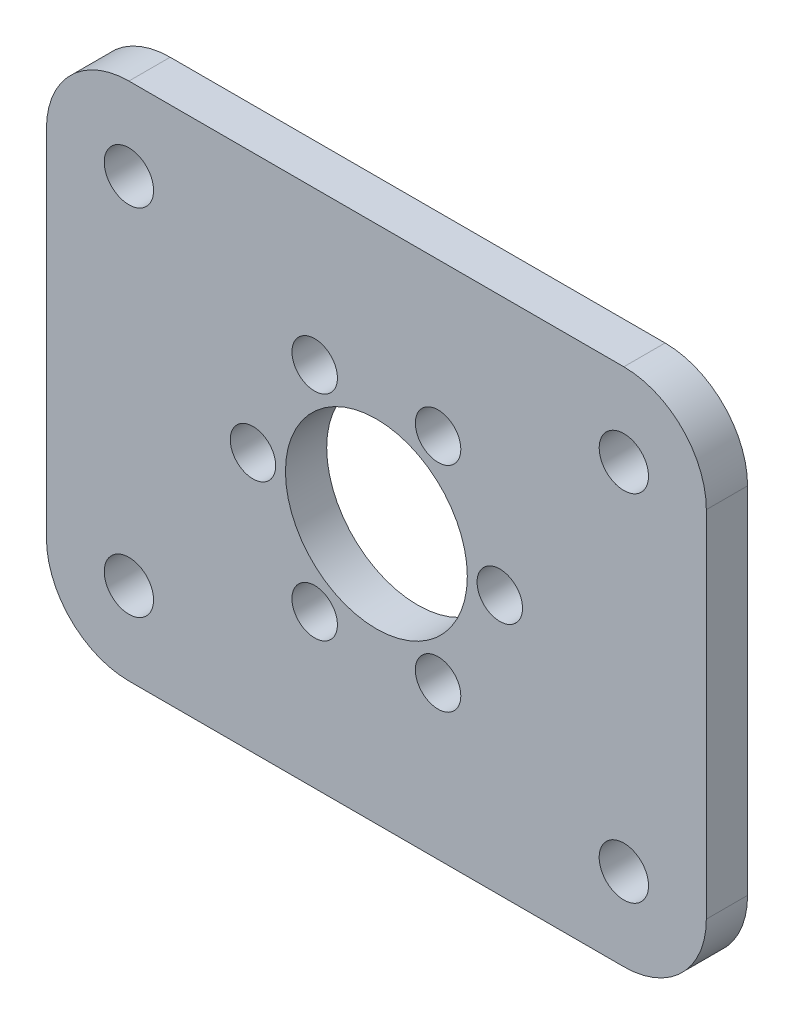
ISO-10303-21;
HEADER;
FILE_DESCRIPTION(('STEP AP214'),'2;1');
FILE_NAME('part.step','',(''),(''),'','','');
FILE_SCHEMA(('AUTOMOTIVE_DESIGN { 1 0 10303 214 1 1 1 1 }'));
ENDSEC;
DATA;
#1=APPLICATION_CONTEXT('core data for automotive mechanical design processes');
#2=APPLICATION_PROTOCOL_DEFINITION('international standard','automotive_design',2000,#1);
#3=PRODUCT_CONTEXT('',#1,'mechanical');
#4=PRODUCT('Part','Part','',(#3));
#5=PRODUCT_RELATED_PRODUCT_CATEGORY('part','',(#4));
#6=PRODUCT_DEFINITION_FORMATION('','',#4);
#7=PRODUCT_DEFINITION_CONTEXT('part definition',#1,'design');
#8=PRODUCT_DEFINITION('design','',#6,#7);
#9=PRODUCT_DEFINITION_SHAPE('','',#8);
#10=(LENGTH_UNIT() NAMED_UNIT(*) SI_UNIT(.MILLI.,.METRE.));
#11=(NAMED_UNIT(*) PLANE_ANGLE_UNIT() SI_UNIT($,.RADIAN.));
#12=(NAMED_UNIT(*) SI_UNIT($,.STERADIAN.) SOLID_ANGLE_UNIT());
#13=UNCERTAINTY_MEASURE_WITH_UNIT(LENGTH_MEASURE(1.E-05),#10,'distance_accuracy_value','');
#14=(GEOMETRIC_REPRESENTATION_CONTEXT(3) GLOBAL_UNCERTAINTY_ASSIGNED_CONTEXT((#13)) GLOBAL_UNIT_ASSIGNED_CONTEXT((#10,
#11,#12)) REPRESENTATION_CONTEXT('',''));
#15=CARTESIAN_POINT('',(0.,0.,0.));
#16=DIRECTION('',(0.,0.,1.));
#17=DIRECTION('',(1.,0.,0.));
#18=AXIS2_PLACEMENT_3D('',#15,#16,#17);
#19=CARTESIAN_POINT('',(-25.4,-20.,3.175));
#20=DIRECTION('',(0.,0.,1.));
#21=DIRECTION('',(1.,0.,0.));
#22=AXIS2_PLACEMENT_3D('',#19,#20,#21);
#23=PLANE('',#22);
#24=CARTESIAN_POINT('',(19.05,13.65,3.175));
#25=DIRECTION('',(0.,0.,1.));
#26=DIRECTION('',(-1.,0.,0.));
#27=AXIS2_PLACEMENT_3D('',#24,#25,#26);
#28=CIRCLE('',#27,1.89865);
#29=CARTESIAN_POINT('',(17.15135,13.65,3.175));
#30=VERTEX_POINT('',#29);
#31=EDGE_CURVE('E237',#30,#30,#28,.T.);
#32=ORIENTED_EDGE('',*,*,#31,.F.);
#33=EDGE_LOOP('',(#32));
#34=FACE_BOUND('',#33,.T.);
#35=CARTESIAN_POINT('',(-19.05,-13.65,3.175));
#36=DIRECTION('',(0.,0.,1.));
#37=DIRECTION('',(-1.,0.,0.));
#38=AXIS2_PLACEMENT_3D('',#35,#36,#37);
#39=CIRCLE('',#38,1.89865);
#40=CARTESIAN_POINT('',(-20.94865,-13.65,3.175));
#41=VERTEX_POINT('',#40);
#42=EDGE_CURVE('E231',#41,#41,#39,.T.);
#43=ORIENTED_EDGE('',*,*,#42,.F.);
#44=EDGE_LOOP('',(#43));
#45=FACE_BOUND('',#44,.T.);
#46=CARTESIAN_POINT('',(-19.05,13.65,3.175));
#47=DIRECTION('',(0.,0.,1.));
#48=DIRECTION('',(1.,0.,0.));
#49=AXIS2_PLACEMENT_3D('',#46,#47,#48);
#50=CIRCLE('',#49,1.89865);
#51=CARTESIAN_POINT('',(-17.15135,13.65,3.175));
#52=VERTEX_POINT('',#51);
#53=EDGE_CURVE('E225',#52,#52,#50,.T.);
#54=ORIENTED_EDGE('',*,*,#53,.F.);
#55=EDGE_LOOP('',(#54));
#56=FACE_BOUND('',#55,.T.);
#57=CARTESIAN_POINT('',(19.05,-13.65,3.175));
#58=DIRECTION('',(0.,0.,1.));
#59=DIRECTION('',(1.,0.,0.));
#60=AXIS2_PLACEMENT_3D('',#57,#58,#59);
#61=CIRCLE('',#60,1.89865);
#62=CARTESIAN_POINT('',(20.94865,-13.65,3.175));
#63=VERTEX_POINT('',#62);
#64=EDGE_CURVE('E219',#63,#63,#61,.T.);
#65=ORIENTED_EDGE('',*,*,#64,.F.);
#66=EDGE_LOOP('',(#65));
#67=FACE_BOUND('',#66,.T.);
#68=CARTESIAN_POINT('',(4.75,8.22724133595217,3.175));
#69=DIRECTION('',(0.,0.,1.));
#70=DIRECTION('',(1.,0.,0.));
#71=AXIS2_PLACEMENT_3D('',#68,#69,#70);
#72=CIRCLE('',#71,1.75);
#73=CARTESIAN_POINT('',(6.5,8.22724133595217,3.175));
#74=VERTEX_POINT('',#73);
#75=EDGE_CURVE('E213',#74,#74,#72,.T.);
#76=ORIENTED_EDGE('',*,*,#75,.F.);
#77=EDGE_LOOP('',(#76));
#78=FACE_BOUND('',#77,.T.);
#79=CARTESIAN_POINT('',(-4.75,8.22724133595217,3.175));
#80=DIRECTION('',(0.,0.,1.));
#81=DIRECTION('',(1.,0.,0.));
#82=AXIS2_PLACEMENT_3D('',#79,#80,#81);
#83=CIRCLE('',#82,1.75);
#84=CARTESIAN_POINT('',(-3.,8.22724133595217,3.175));
#85=VERTEX_POINT('',#84);
#86=EDGE_CURVE('E207',#85,#85,#83,.T.);
#87=ORIENTED_EDGE('',*,*,#86,.F.);
#88=EDGE_LOOP('',(#87));
#89=FACE_BOUND('',#88,.T.);
#90=CARTESIAN_POINT('',(-9.5,0.,3.175));
#91=DIRECTION('',(0.,0.,1.));
#92=DIRECTION('',(1.,0.,0.));
#93=AXIS2_PLACEMENT_3D('',#90,#91,#92);
#94=CIRCLE('',#93,1.75);
#95=CARTESIAN_POINT('',(-7.75,0.,3.175));
#96=VERTEX_POINT('',#95);
#97=EDGE_CURVE('E201',#96,#96,#94,.T.);
#98=ORIENTED_EDGE('',*,*,#97,.F.);
#99=EDGE_LOOP('',(#98));
#100=FACE_BOUND('',#99,.T.);
#101=CARTESIAN_POINT('',(-4.75,-8.22724133595217,3.175));
#102=DIRECTION('',(0.,0.,1.));
#103=DIRECTION('',(1.,0.,0.));
#104=AXIS2_PLACEMENT_3D('',#101,#102,#103);
#105=CIRCLE('',#104,1.75);
#106=CARTESIAN_POINT('',(-3.,-8.22724133595217,3.175));
#107=VERTEX_POINT('',#106);
#108=EDGE_CURVE('E195',#107,#107,#105,.T.);
#109=ORIENTED_EDGE('',*,*,#108,.F.);
#110=EDGE_LOOP('',(#109));
#111=FACE_BOUND('',#110,.T.);
#112=CARTESIAN_POINT('',(4.75,-8.22724133595217,3.175));
#113=DIRECTION('',(0.,0.,1.));
#114=DIRECTION('',(1.,0.,0.));
#115=AXIS2_PLACEMENT_3D('',#112,#113,#114);
#116=CIRCLE('',#115,1.75);
#117=CARTESIAN_POINT('',(6.5,-8.22724133595217,3.175));
#118=VERTEX_POINT('',#117);
#119=EDGE_CURVE('E189',#118,#118,#116,.T.);
#120=ORIENTED_EDGE('',*,*,#119,.F.);
#121=EDGE_LOOP('',(#120));
#122=FACE_BOUND('',#121,.T.);
#123=CARTESIAN_POINT('',(9.5,0.,3.175));
#124=DIRECTION('',(0.,0.,1.));
#125=DIRECTION('',(1.,0.,0.));
#126=AXIS2_PLACEMENT_3D('',#123,#124,#125);
#127=CIRCLE('',#126,1.75);
#128=CARTESIAN_POINT('',(11.25,0.,3.175));
#129=VERTEX_POINT('',#128);
#130=EDGE_CURVE('E183',#129,#129,#127,.T.);
#131=ORIENTED_EDGE('',*,*,#130,.F.);
#132=EDGE_LOOP('',(#131));
#133=FACE_BOUND('',#132,.T.);
#134=DIRECTION('',(0.,-1.,0.));
#135=VECTOR('',#134,1.);
#136=CARTESIAN_POINT('',(-25.4,20.,3.175));
#137=LINE('',#136,#135);
#138=CARTESIAN_POINT('',(-25.4,13.65,3.175));
#139=VERTEX_POINT('',#138);
#140=CARTESIAN_POINT('',(-25.4,-13.65,3.175));
#141=VERTEX_POINT('',#140);
#142=EDGE_CURVE('E137',#139,#141,#137,.T.);
#143=ORIENTED_EDGE('',*,*,#142,.T.);
#144=CARTESIAN_POINT('',(-19.05,-13.65,3.175));
#145=DIRECTION('',(0.,0.,1.));
#146=DIRECTION('',(1.,0.,0.));
#147=AXIS2_PLACEMENT_3D('',#144,#145,#146);
#148=CIRCLE('',#147,6.35);
#149=CARTESIAN_POINT('',(-19.05,-20.,3.175));
#150=VERTEX_POINT('',#149);
#151=EDGE_CURVE('E152',#141,#150,#148,.T.);
#152=ORIENTED_EDGE('',*,*,#151,.T.);
#153=DIRECTION('',(1.,0.,0.));
#154=VECTOR('',#153,1.);
#155=CARTESIAN_POINT('',(-25.4,-20.,3.175));
#156=LINE('',#155,#154);
#157=CARTESIAN_POINT('',(19.05,-20.,3.175));
#158=VERTEX_POINT('',#157);
#159=EDGE_CURVE('E119',#150,#158,#156,.T.);
#160=ORIENTED_EDGE('',*,*,#159,.T.);
#161=CARTESIAN_POINT('',(19.05,-13.65,3.175));
#162=DIRECTION('',(0.,0.,1.));
#163=DIRECTION('',(1.,0.,0.));
#164=AXIS2_PLACEMENT_3D('',#161,#162,#163);
#165=CIRCLE('',#164,6.35);
#166=CARTESIAN_POINT('',(25.4,-13.65,3.175));
#167=VERTEX_POINT('',#166);
#168=EDGE_CURVE('E150',#158,#167,#165,.T.);
#169=ORIENTED_EDGE('',*,*,#168,.T.);
#170=DIRECTION('',(0.,1.,0.));
#171=VECTOR('',#170,1.);
#172=CARTESIAN_POINT('',(25.4,20.,3.175));
#173=LINE('',#172,#171);
#174=CARTESIAN_POINT('',(25.4,13.65,3.175));
#175=VERTEX_POINT('',#174);
#176=EDGE_CURVE('E163',#167,#175,#173,.T.);
#177=ORIENTED_EDGE('',*,*,#176,.T.);
#178=CARTESIAN_POINT('',(19.05,13.65,3.175));
#179=DIRECTION('',(0.,0.,1.));
#180=DIRECTION('',(1.,0.,0.));
#181=AXIS2_PLACEMENT_3D('',#178,#179,#180);
#182=CIRCLE('',#181,6.35);
#183=CARTESIAN_POINT('',(19.05,20.,3.175));
#184=VERTEX_POINT('',#183);
#185=EDGE_CURVE('E54',#175,#184,#182,.T.);
#186=ORIENTED_EDGE('',*,*,#185,.T.);
#187=DIRECTION('',(-1.,0.,0.));
#188=VECTOR('',#187,1.);
#189=CARTESIAN_POINT('',(25.4,20.,3.175));
#190=LINE('',#189,#188);
#191=CARTESIAN_POINT('',(-19.05,20.,3.175));
#192=VERTEX_POINT('',#191);
#193=EDGE_CURVE('E138',#184,#192,#190,.T.);
#194=ORIENTED_EDGE('',*,*,#193,.T.);
#195=CARTESIAN_POINT('',(-19.05,13.65,3.175));
#196=DIRECTION('',(0.,0.,1.));
#197=DIRECTION('',(1.,0.,0.));
#198=AXIS2_PLACEMENT_3D('',#195,#196,#197);
#199=CIRCLE('',#198,6.35);
#200=EDGE_CURVE('E147',#192,#139,#199,.T.);
#201=ORIENTED_EDGE('',*,*,#200,.T.);
#202=EDGE_LOOP('',(#143,#152,#160,#169,#177,#186,#194,#201));
#203=FACE_BOUND('',#202,.T.);
#204=CARTESIAN_POINT('',(0.,0.,3.175));
#205=DIRECTION('',(0.,0.,1.));
#206=DIRECTION('',(1.,0.,0.));
#207=AXIS2_PLACEMENT_3D('',#204,#205,#206);
#208=CIRCLE('',#207,7.);
#209=CARTESIAN_POINT('',(7.,0.,3.175));
#210=VERTEX_POINT('',#209);
#211=EDGE_CURVE('E132',#210,#210,#208,.T.);
#212=ORIENTED_EDGE('',*,*,#211,.F.);
#213=EDGE_LOOP('',(#212));
#214=FACE_BOUND('',#213,.T.);
#215=ADVANCED_FACE('F33',(#34,#45,#56,#67,#78,#89,#100,#111,#122,#133,#203,#214),#23,.T.);
#216=CARTESIAN_POINT('',(-25.4,-20.,0.));
#217=DIRECTION('',(0.,0.,1.));
#218=DIRECTION('',(1.,0.,0.));
#219=AXIS2_PLACEMENT_3D('',#216,#217,#218);
#220=PLANE('',#219);
#221=CARTESIAN_POINT('',(19.05,13.65,0.));
#222=DIRECTION('',(0.,0.,1.));
#223=DIRECTION('',(-1.,0.,0.));
#224=AXIS2_PLACEMENT_3D('',#221,#222,#223);
#225=CIRCLE('',#224,1.89865);
#226=CARTESIAN_POINT('',(17.15135,13.65,0.));
#227=VERTEX_POINT('',#226);
#228=EDGE_CURVE('E222',#227,#227,#225,.T.);
#229=ORIENTED_EDGE('',*,*,#228,.T.);
#230=EDGE_LOOP('',(#229));
#231=FACE_BOUND('',#230,.T.);
#232=CARTESIAN_POINT('',(-19.05,-13.65,0.));
#233=DIRECTION('',(0.,0.,1.));
#234=DIRECTION('',(-1.,0.,0.));
#235=AXIS2_PLACEMENT_3D('',#232,#233,#234);
#236=CIRCLE('',#235,1.89865);
#237=CARTESIAN_POINT('',(-20.94865,-13.65,0.));
#238=VERTEX_POINT('',#237);
#239=EDGE_CURVE('E234',#238,#238,#236,.T.);
#240=ORIENTED_EDGE('',*,*,#239,.T.);
#241=EDGE_LOOP('',(#240));
#242=FACE_BOUND('',#241,.T.);
#243=CARTESIAN_POINT('',(-19.05,13.65,0.));
#244=DIRECTION('',(0.,0.,1.));
#245=DIRECTION('',(1.,0.,0.));
#246=AXIS2_PLACEMENT_3D('',#243,#244,#245);
#247=CIRCLE('',#246,1.89865);
#248=CARTESIAN_POINT('',(-17.15135,13.65,0.));
#249=VERTEX_POINT('',#248);
#250=EDGE_CURVE('E228',#249,#249,#247,.T.);
#251=ORIENTED_EDGE('',*,*,#250,.T.);
#252=EDGE_LOOP('',(#251));
#253=FACE_BOUND('',#252,.T.);
#254=CARTESIAN_POINT('',(19.05,-13.65,0.));
#255=DIRECTION('',(0.,0.,1.));
#256=DIRECTION('',(1.,0.,0.));
#257=AXIS2_PLACEMENT_3D('',#254,#255,#256);
#258=CIRCLE('',#257,1.89865);
#259=CARTESIAN_POINT('',(20.94865,-13.65,0.));
#260=VERTEX_POINT('',#259);
#261=EDGE_CURVE('E216',#260,#260,#258,.T.);
#262=ORIENTED_EDGE('',*,*,#261,.T.);
#263=EDGE_LOOP('',(#262));
#264=FACE_BOUND('',#263,.T.);
#265=CARTESIAN_POINT('',(4.75,8.22724133595217,0.));
#266=DIRECTION('',(0.,0.,1.));
#267=DIRECTION('',(1.,0.,0.));
#268=AXIS2_PLACEMENT_3D('',#265,#266,#267);
#269=CIRCLE('',#268,1.75);
#270=CARTESIAN_POINT('',(6.5,8.22724133595217,0.));
#271=VERTEX_POINT('',#270);
#272=EDGE_CURVE('E210',#271,#271,#269,.T.);
#273=ORIENTED_EDGE('',*,*,#272,.T.);
#274=EDGE_LOOP('',(#273));
#275=FACE_BOUND('',#274,.T.);
#276=CARTESIAN_POINT('',(-4.75,8.22724133595217,0.));
#277=DIRECTION('',(0.,0.,1.));
#278=DIRECTION('',(1.,0.,0.));
#279=AXIS2_PLACEMENT_3D('',#276,#277,#278);
#280=CIRCLE('',#279,1.75);
#281=CARTESIAN_POINT('',(-3.,8.22724133595217,0.));
#282=VERTEX_POINT('',#281);
#283=EDGE_CURVE('E204',#282,#282,#280,.T.);
#284=ORIENTED_EDGE('',*,*,#283,.T.);
#285=EDGE_LOOP('',(#284));
#286=FACE_BOUND('',#285,.T.);
#287=CARTESIAN_POINT('',(-9.5,0.,0.));
#288=DIRECTION('',(0.,0.,1.));
#289=DIRECTION('',(1.,0.,0.));
#290=AXIS2_PLACEMENT_3D('',#287,#288,#289);
#291=CIRCLE('',#290,1.75);
#292=CARTESIAN_POINT('',(-7.75,0.,0.));
#293=VERTEX_POINT('',#292);
#294=EDGE_CURVE('E198',#293,#293,#291,.T.);
#295=ORIENTED_EDGE('',*,*,#294,.T.);
#296=EDGE_LOOP('',(#295));
#297=FACE_BOUND('',#296,.T.);
#298=CARTESIAN_POINT('',(-4.75,-8.22724133595217,0.));
#299=DIRECTION('',(0.,0.,1.));
#300=DIRECTION('',(1.,0.,0.));
#301=AXIS2_PLACEMENT_3D('',#298,#299,#300);
#302=CIRCLE('',#301,1.75);
#303=CARTESIAN_POINT('',(-3.,-8.22724133595217,0.));
#304=VERTEX_POINT('',#303);
#305=EDGE_CURVE('E192',#304,#304,#302,.T.);
#306=ORIENTED_EDGE('',*,*,#305,.T.);
#307=EDGE_LOOP('',(#306));
#308=FACE_BOUND('',#307,.T.);
#309=CARTESIAN_POINT('',(4.75,-8.22724133595217,0.));
#310=DIRECTION('',(0.,0.,1.));
#311=DIRECTION('',(1.,0.,0.));
#312=AXIS2_PLACEMENT_3D('',#309,#310,#311);
#313=CIRCLE('',#312,1.75);
#314=CARTESIAN_POINT('',(6.5,-8.22724133595217,0.));
#315=VERTEX_POINT('',#314);
#316=EDGE_CURVE('E186',#315,#315,#313,.T.);
#317=ORIENTED_EDGE('',*,*,#316,.T.);
#318=EDGE_LOOP('',(#317));
#319=FACE_BOUND('',#318,.T.);
#320=CARTESIAN_POINT('',(9.5,0.,0.));
#321=DIRECTION('',(0.,0.,1.));
#322=DIRECTION('',(1.,0.,0.));
#323=AXIS2_PLACEMENT_3D('',#320,#321,#322);
#324=CIRCLE('',#323,1.75);
#325=CARTESIAN_POINT('',(11.25,0.,0.));
#326=VERTEX_POINT('',#325);
#327=EDGE_CURVE('E180',#326,#326,#324,.T.);
#328=ORIENTED_EDGE('',*,*,#327,.T.);
#329=EDGE_LOOP('',(#328));
#330=FACE_BOUND('',#329,.T.);
#331=DIRECTION('',(1.,0.,0.));
#332=VECTOR('',#331,1.);
#333=CARTESIAN_POINT('',(-25.4,-20.,0.));
#334=LINE('',#333,#332);
#335=CARTESIAN_POINT('',(-19.05,-20.,0.));
#336=VERTEX_POINT('',#335);
#337=CARTESIAN_POINT('',(19.05,-20.,0.));
#338=VERTEX_POINT('',#337);
#339=EDGE_CURVE('E116',#336,#338,#334,.T.);
#340=ORIENTED_EDGE('',*,*,#339,.F.);
#341=CARTESIAN_POINT('',(-19.05,-13.65,0.));
#342=DIRECTION('',(0.,0.,1.));
#343=DIRECTION('',(1.,0.,0.));
#344=AXIS2_PLACEMENT_3D('',#341,#342,#343);
#345=CIRCLE('',#344,6.35);
#346=CARTESIAN_POINT('',(-25.4,-13.65,0.));
#347=VERTEX_POINT('',#346);
#348=EDGE_CURVE('E99',#336,#347,#345,.F.);
#349=ORIENTED_EDGE('',*,*,#348,.T.);
#350=DIRECTION('',(0.,-1.,0.));
#351=VECTOR('',#350,1.);
#352=CARTESIAN_POINT('',(-25.4,20.,0.));
#353=LINE('',#352,#351);
#354=CARTESIAN_POINT('',(-25.4,13.65,0.));
#355=VERTEX_POINT('',#354);
#356=EDGE_CURVE('E127',#355,#347,#353,.T.);
#357=ORIENTED_EDGE('',*,*,#356,.F.);
#358=CARTESIAN_POINT('',(-19.05,13.65,0.));
#359=DIRECTION('',(0.,0.,1.));
#360=DIRECTION('',(1.,0.,0.));
#361=AXIS2_PLACEMENT_3D('',#358,#359,#360);
#362=CIRCLE('',#361,6.35);
#363=CARTESIAN_POINT('',(-19.05,20.,0.));
#364=VERTEX_POINT('',#363);
#365=EDGE_CURVE('E120',#355,#364,#362,.F.);
#366=ORIENTED_EDGE('',*,*,#365,.T.);
#367=DIRECTION('',(-1.,0.,0.));
#368=VECTOR('',#367,1.);
#369=CARTESIAN_POINT('',(25.4,20.,0.));
#370=LINE('',#369,#368);
#371=CARTESIAN_POINT('',(19.05,20.,0.));
#372=VERTEX_POINT('',#371);
#373=EDGE_CURVE('E130',#372,#364,#370,.T.);
#374=ORIENTED_EDGE('',*,*,#373,.F.);
#375=CARTESIAN_POINT('',(19.05,13.65,0.));
#376=DIRECTION('',(0.,0.,1.));
#377=DIRECTION('',(1.,0.,0.));
#378=AXIS2_PLACEMENT_3D('',#375,#376,#377);
#379=CIRCLE('',#378,6.35);
#380=CARTESIAN_POINT('',(25.4,13.65,0.));
#381=VERTEX_POINT('',#380);
#382=EDGE_CURVE('E141',#372,#381,#379,.F.);
#383=ORIENTED_EDGE('',*,*,#382,.T.);
#384=DIRECTION('',(0.,1.,0.));
#385=VECTOR('',#384,1.);
#386=CARTESIAN_POINT('',(25.4,20.,0.));
#387=LINE('',#386,#385);
#388=CARTESIAN_POINT('',(25.4,-13.65,0.));
#389=VERTEX_POINT('',#388);
#390=EDGE_CURVE('E126',#389,#381,#387,.T.);
#391=ORIENTED_EDGE('',*,*,#390,.F.);
#392=CARTESIAN_POINT('',(19.05,-13.65,0.));
#393=DIRECTION('',(0.,0.,1.));
#394=DIRECTION('',(1.,0.,0.));
#395=AXIS2_PLACEMENT_3D('',#392,#393,#394);
#396=CIRCLE('',#395,6.35);
#397=EDGE_CURVE('E110',#389,#338,#396,.F.);
#398=ORIENTED_EDGE('',*,*,#397,.T.);
#399=EDGE_LOOP('',(#340,#349,#357,#366,#374,#383,#391,#398));
#400=FACE_BOUND('',#399,.T.);
#401=CARTESIAN_POINT('',(0.,0.,0.));
#402=DIRECTION('',(0.,0.,1.));
#403=DIRECTION('',(1.,0.,0.));
#404=AXIS2_PLACEMENT_3D('',#401,#402,#403);
#405=CIRCLE('',#404,7.);
#406=CARTESIAN_POINT('',(7.,0.,0.));
#407=VERTEX_POINT('',#406);
#408=EDGE_CURVE('E177',#407,#407,#405,.T.);
#409=ORIENTED_EDGE('',*,*,#408,.T.);
#410=EDGE_LOOP('',(#409));
#411=FACE_BOUND('',#410,.T.);
#412=ADVANCED_FACE('F123',(#231,#242,#253,#264,#275,#286,#297,#308,#319,#330,#400,#411),#220,.F.);
#413=CARTESIAN_POINT('',(-25.4,20.,3.175));
#414=DIRECTION('',(1.,0.,0.));
#415=DIRECTION('',(0.,1.,0.));
#416=AXIS2_PLACEMENT_3D('',#413,#414,#415);
#417=PLANE('',#416);
#418=ORIENTED_EDGE('',*,*,#356,.T.);
#419=DIRECTION('',(0.,0.,-1.));
#420=VECTOR('',#419,1.);
#421=CARTESIAN_POINT('',(-25.4,-13.65,3.175));
#422=LINE('',#421,#420);
#423=EDGE_CURVE('E104',#347,#141,#422,.F.);
#424=ORIENTED_EDGE('',*,*,#423,.T.);
#425=ORIENTED_EDGE('',*,*,#142,.F.);
#426=DIRECTION('',(0.,0.,-1.));
#427=VECTOR('',#426,1.);
#428=CARTESIAN_POINT('',(-25.4,13.65,3.175));
#429=LINE('',#428,#427);
#430=EDGE_CURVE('E109',#139,#355,#429,.T.);
#431=ORIENTED_EDGE('',*,*,#430,.T.);
#432=EDGE_LOOP('',(#418,#424,#425,#431));
#433=FACE_BOUND('',#432,.T.);
#434=ADVANCED_FACE('F282',(#433),#417,.F.);
#435=CARTESIAN_POINT('',(-25.4,-20.,3.175));
#436=DIRECTION('',(0.,1.,0.));
#437=DIRECTION('',(-1.,0.,0.));
#438=AXIS2_PLACEMENT_3D('',#435,#436,#437);
#439=PLANE('',#438);
#440=ORIENTED_EDGE('',*,*,#159,.F.);
#441=DIRECTION('',(0.,0.,-1.));
#442=VECTOR('',#441,1.);
#443=CARTESIAN_POINT('',(-19.05,-20.,3.175));
#444=LINE('',#443,#442);
#445=EDGE_CURVE('E103',#150,#336,#444,.T.);
#446=ORIENTED_EDGE('',*,*,#445,.T.);
#447=ORIENTED_EDGE('',*,*,#339,.T.);
#448=DIRECTION('',(0.,0.,-1.));
#449=VECTOR('',#448,1.);
#450=CARTESIAN_POINT('',(19.05,-20.,3.175));
#451=LINE('',#450,#449);
#452=EDGE_CURVE('E121',#338,#158,#451,.F.);
#453=ORIENTED_EDGE('',*,*,#452,.T.);
#454=EDGE_LOOP('',(#440,#446,#447,#453));
#455=FACE_BOUND('',#454,.T.);
#456=ADVANCED_FACE('F115',(#455),#439,.F.);
#457=CARTESIAN_POINT('',(25.4,20.,3.175));
#458=DIRECTION('',(-1.,0.,0.));
#459=DIRECTION('',(0.,-1.,0.));
#460=AXIS2_PLACEMENT_3D('',#457,#458,#459);
#461=PLANE('',#460);
#462=ORIENTED_EDGE('',*,*,#176,.F.);
#463=DIRECTION('',(0.,0.,-1.));
#464=VECTOR('',#463,1.);
#465=CARTESIAN_POINT('',(25.4,-13.65,3.175));
#466=LINE('',#465,#464);
#467=EDGE_CURVE('E156',#167,#389,#466,.T.);
#468=ORIENTED_EDGE('',*,*,#467,.T.);
#469=ORIENTED_EDGE('',*,*,#390,.T.);
#470=DIRECTION('',(0.,0.,-1.));
#471=VECTOR('',#470,1.);
#472=CARTESIAN_POINT('',(25.4,13.65,3.175));
#473=LINE('',#472,#471);
#474=EDGE_CURVE('E154',#381,#175,#473,.F.);
#475=ORIENTED_EDGE('',*,*,#474,.T.);
#476=EDGE_LOOP('',(#462,#468,#469,#475));
#477=FACE_BOUND('',#476,.T.);
#478=ADVANCED_FACE('F161',(#477),#461,.F.);
#479=CARTESIAN_POINT('',(25.4,20.,3.175));
#480=DIRECTION('',(0.,-1.,0.));
#481=DIRECTION('',(0.,0.,-1.));
#482=AXIS2_PLACEMENT_3D('',#479,#480,#481);
#483=PLANE('',#482);
#484=ORIENTED_EDGE('',*,*,#193,.F.);
#485=DIRECTION('',(0.,0.,-1.));
#486=VECTOR('',#485,1.);
#487=CARTESIAN_POINT('',(19.05,20.,3.175));
#488=LINE('',#487,#486);
#489=EDGE_CURVE('E11',#184,#372,#488,.T.);
#490=ORIENTED_EDGE('',*,*,#489,.T.);
#491=ORIENTED_EDGE('',*,*,#373,.T.);
#492=DIRECTION('',(0.,0.,-1.));
#493=VECTOR('',#492,1.);
#494=CARTESIAN_POINT('',(-19.05,20.,3.175));
#495=LINE('',#494,#493);
#496=EDGE_CURVE('E41',#364,#192,#495,.F.);
#497=ORIENTED_EDGE('',*,*,#496,.T.);
#498=EDGE_LOOP('',(#484,#490,#491,#497));
#499=FACE_BOUND('',#498,.T.);
#500=ADVANCED_FACE('F170',(#499),#483,.F.);
#501=CARTESIAN_POINT('',(0.,0.,3.175));
#502=DIRECTION('',(0.,0.,-1.));
#503=DIRECTION('',(-1.,0.,0.));
#504=AXIS2_PLACEMENT_3D('',#501,#502,#503);
#505=CYLINDRICAL_SURFACE('',#504,7.);
#506=ORIENTED_EDGE('',*,*,#211,.T.);
#507=EDGE_LOOP('',(#506));
#508=FACE_BOUND('',#507,.T.);
#509=ORIENTED_EDGE('',*,*,#408,.F.);
#510=EDGE_LOOP('',(#509));
#511=FACE_BOUND('',#510,.T.);
#512=ADVANCED_FACE('F276',(#508,#511),#505,.F.);
#513=CARTESIAN_POINT('',(-19.05,-13.65,3.175));
#514=DIRECTION('',(0.,0.,-1.));
#515=DIRECTION('',(-1.,0.,0.));
#516=AXIS2_PLACEMENT_3D('',#513,#514,#515);
#517=CYLINDRICAL_SURFACE('',#516,6.35);
#518=ORIENTED_EDGE('',*,*,#151,.F.);
#519=ORIENTED_EDGE('',*,*,#423,.F.);
#520=ORIENTED_EDGE('',*,*,#348,.F.);
#521=ORIENTED_EDGE('',*,*,#445,.F.);
#522=EDGE_LOOP('',(#518,#519,#520,#521));
#523=FACE_BOUND('',#522,.T.);
#524=ADVANCED_FACE('F102',(#523),#517,.T.);
#525=CARTESIAN_POINT('',(19.05,-13.65,3.175));
#526=DIRECTION('',(0.,0.,-1.));
#527=DIRECTION('',(-1.,0.,0.));
#528=AXIS2_PLACEMENT_3D('',#525,#526,#527);
#529=CYLINDRICAL_SURFACE('',#528,6.35);
#530=ORIENTED_EDGE('',*,*,#168,.F.);
#531=ORIENTED_EDGE('',*,*,#452,.F.);
#532=ORIENTED_EDGE('',*,*,#397,.F.);
#533=ORIENTED_EDGE('',*,*,#467,.F.);
#534=EDGE_LOOP('',(#530,#531,#532,#533));
#535=FACE_BOUND('',#534,.T.);
#536=ADVANCED_FACE('F298',(#535),#529,.T.);
#537=CARTESIAN_POINT('',(19.05,13.65,3.175));
#538=DIRECTION('',(0.,0.,-1.));
#539=DIRECTION('',(-1.,0.,0.));
#540=AXIS2_PLACEMENT_3D('',#537,#538,#539);
#541=CYLINDRICAL_SURFACE('',#540,6.35);
#542=ORIENTED_EDGE('',*,*,#185,.F.);
#543=ORIENTED_EDGE('',*,*,#474,.F.);
#544=ORIENTED_EDGE('',*,*,#382,.F.);
#545=ORIENTED_EDGE('',*,*,#489,.F.);
#546=EDGE_LOOP('',(#542,#543,#544,#545));
#547=FACE_BOUND('',#546,.T.);
#548=ADVANCED_FACE('F169',(#547),#541,.T.);
#549=CARTESIAN_POINT('',(-19.05,13.65,3.175));
#550=DIRECTION('',(0.,0.,-1.));
#551=DIRECTION('',(-1.,0.,0.));
#552=AXIS2_PLACEMENT_3D('',#549,#550,#551);
#553=CYLINDRICAL_SURFACE('',#552,6.35);
#554=ORIENTED_EDGE('',*,*,#200,.F.);
#555=ORIENTED_EDGE('',*,*,#496,.F.);
#556=ORIENTED_EDGE('',*,*,#365,.F.);
#557=ORIENTED_EDGE('',*,*,#430,.F.);
#558=EDGE_LOOP('',(#554,#555,#556,#557));
#559=FACE_BOUND('',#558,.T.);
#560=ADVANCED_FACE('F35',(#559),#553,.T.);
#561=CARTESIAN_POINT('',(9.5,0.,0.));
#562=DIRECTION('',(0.,0.,1.));
#563=DIRECTION('',(1.,0.,0.));
#564=AXIS2_PLACEMENT_3D('',#561,#562,#563);
#565=CYLINDRICAL_SURFACE('',#564,1.75);
#566=ORIENTED_EDGE('',*,*,#327,.F.);
#567=EDGE_LOOP('',(#566));
#568=FACE_BOUND('',#567,.T.);
#569=ORIENTED_EDGE('',*,*,#130,.T.);
#570=EDGE_LOOP('',(#569));
#571=FACE_BOUND('',#570,.T.);
#572=ADVANCED_FACE('F304',(#568,#571),#565,.F.);
#573=CARTESIAN_POINT('',(4.75,-8.22724133595217,0.));
#574=DIRECTION('',(0.,0.,1.));
#575=DIRECTION('',(1.,0.,0.));
#576=AXIS2_PLACEMENT_3D('',#573,#574,#575);
#577=CYLINDRICAL_SURFACE('',#576,1.75);
#578=ORIENTED_EDGE('',*,*,#316,.F.);
#579=EDGE_LOOP('',(#578));
#580=FACE_BOUND('',#579,.T.);
#581=ORIENTED_EDGE('',*,*,#119,.T.);
#582=EDGE_LOOP('',(#581));
#583=FACE_BOUND('',#582,.T.);
#584=ADVANCED_FACE('F309',(#580,#583),#577,.F.);
#585=CARTESIAN_POINT('',(-4.75,-8.22724133595217,0.));
#586=DIRECTION('',(0.,0.,1.));
#587=DIRECTION('',(1.,0.,0.));
#588=AXIS2_PLACEMENT_3D('',#585,#586,#587);
#589=CYLINDRICAL_SURFACE('',#588,1.75);
#590=ORIENTED_EDGE('',*,*,#305,.F.);
#591=EDGE_LOOP('',(#590));
#592=FACE_BOUND('',#591,.T.);
#593=ORIENTED_EDGE('',*,*,#108,.T.);
#594=EDGE_LOOP('',(#593));
#595=FACE_BOUND('',#594,.T.);
#596=ADVANCED_FACE('F316',(#592,#595),#589,.F.);
#597=CARTESIAN_POINT('',(-9.5,0.,0.));
#598=DIRECTION('',(0.,0.,1.));
#599=DIRECTION('',(1.,0.,0.));
#600=AXIS2_PLACEMENT_3D('',#597,#598,#599);
#601=CYLINDRICAL_SURFACE('',#600,1.75);
#602=ORIENTED_EDGE('',*,*,#294,.F.);
#603=EDGE_LOOP('',(#602));
#604=FACE_BOUND('',#603,.T.);
#605=ORIENTED_EDGE('',*,*,#97,.T.);
#606=EDGE_LOOP('',(#605));
#607=FACE_BOUND('',#606,.T.);
#608=ADVANCED_FACE('F324',(#604,#607),#601,.F.);
#609=CARTESIAN_POINT('',(-4.75,8.22724133595217,0.));
#610=DIRECTION('',(0.,0.,1.));
#611=DIRECTION('',(1.,0.,0.));
#612=AXIS2_PLACEMENT_3D('',#609,#610,#611);
#613=CYLINDRICAL_SURFACE('',#612,1.75);
#614=ORIENTED_EDGE('',*,*,#283,.F.);
#615=EDGE_LOOP('',(#614));
#616=FACE_BOUND('',#615,.T.);
#617=ORIENTED_EDGE('',*,*,#86,.T.);
#618=EDGE_LOOP('',(#617));
#619=FACE_BOUND('',#618,.T.);
#620=ADVANCED_FACE('F328',(#616,#619),#613,.F.);
#621=CARTESIAN_POINT('',(4.75,8.22724133595217,0.));
#622=DIRECTION('',(0.,0.,1.));
#623=DIRECTION('',(1.,0.,0.));
#624=AXIS2_PLACEMENT_3D('',#621,#622,#623);
#625=CYLINDRICAL_SURFACE('',#624,1.75);
#626=ORIENTED_EDGE('',*,*,#272,.F.);
#627=EDGE_LOOP('',(#626));
#628=FACE_BOUND('',#627,.T.);
#629=ORIENTED_EDGE('',*,*,#75,.T.);
#630=EDGE_LOOP('',(#629));
#631=FACE_BOUND('',#630,.T.);
#632=ADVANCED_FACE('F332',(#628,#631),#625,.F.);
#633=CARTESIAN_POINT('',(19.05,-13.65,0.));
#634=DIRECTION('',(0.,0.,1.));
#635=DIRECTION('',(1.,0.,0.));
#636=AXIS2_PLACEMENT_3D('',#633,#634,#635);
#637=CYLINDRICAL_SURFACE('',#636,1.89865);
#638=ORIENTED_EDGE('',*,*,#261,.F.);
#639=EDGE_LOOP('',(#638));
#640=FACE_BOUND('',#639,.T.);
#641=ORIENTED_EDGE('',*,*,#64,.T.);
#642=EDGE_LOOP('',(#641));
#643=FACE_BOUND('',#642,.T.);
#644=ADVANCED_FACE('F336',(#640,#643),#637,.F.);
#645=CARTESIAN_POINT('',(-19.05,13.65,0.));
#646=DIRECTION('',(0.,0.,1.));
#647=DIRECTION('',(1.,0.,0.));
#648=AXIS2_PLACEMENT_3D('',#645,#646,#647);
#649=CYLINDRICAL_SURFACE('',#648,1.89865);
#650=ORIENTED_EDGE('',*,*,#250,.F.);
#651=EDGE_LOOP('',(#650));
#652=FACE_BOUND('',#651,.T.);
#653=ORIENTED_EDGE('',*,*,#53,.T.);
#654=EDGE_LOOP('',(#653));
#655=FACE_BOUND('',#654,.T.);
#656=ADVANCED_FACE('F340',(#652,#655),#649,.F.);
#657=CARTESIAN_POINT('',(-19.05,-13.65,0.));
#658=DIRECTION('',(0.,0.,1.));
#659=DIRECTION('',(1.,0.,0.));
#660=AXIS2_PLACEMENT_3D('',#657,#658,#659);
#661=CYLINDRICAL_SURFACE('',#660,1.89865);
#662=ORIENTED_EDGE('',*,*,#239,.F.);
#663=EDGE_LOOP('',(#662));
#664=FACE_BOUND('',#663,.T.);
#665=ORIENTED_EDGE('',*,*,#42,.T.);
#666=EDGE_LOOP('',(#665));
#667=FACE_BOUND('',#666,.T.);
#668=ADVANCED_FACE('F248',(#664,#667),#661,.F.);
#669=CARTESIAN_POINT('',(19.05,13.65,0.));
#670=DIRECTION('',(0.,0.,1.));
#671=DIRECTION('',(1.,0.,0.));
#672=AXIS2_PLACEMENT_3D('',#669,#670,#671);
#673=CYLINDRICAL_SURFACE('',#672,1.89865);
#674=ORIENTED_EDGE('',*,*,#228,.F.);
#675=EDGE_LOOP('',(#674));
#676=FACE_BOUND('',#675,.T.);
#677=ORIENTED_EDGE('',*,*,#31,.T.);
#678=EDGE_LOOP('',(#677));
#679=FACE_BOUND('',#678,.T.);
#680=ADVANCED_FACE('F245',(#676,#679),#673,.F.);
#681=CLOSED_SHELL('',(#215,#412,#434,#456,#478,#500,#512,#524,#536,#548,#560,#572,#584,#596,
#608,#620,#632,#644,#656,#668,#680));
#682=MANIFOLD_SOLID_BREP('B2',#681);
#683=ADVANCED_BREP_SHAPE_REPRESENTATION('',(#18,#682),#14);
#684=SHAPE_DEFINITION_REPRESENTATION(#9,#683);
ENDSEC;
END-ISO-10303-21;
